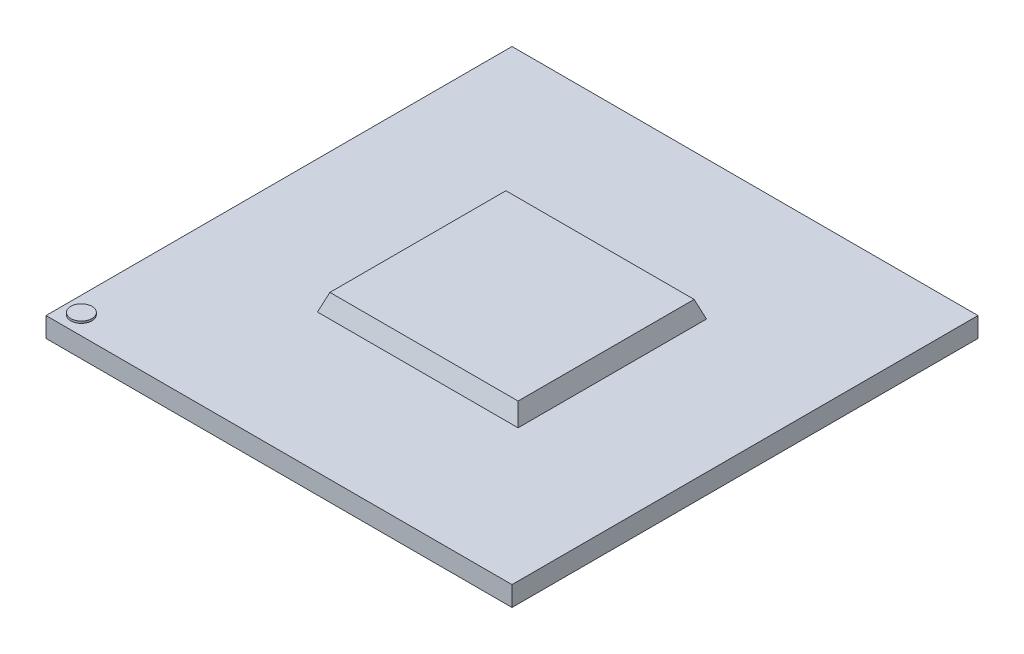
ISO-10303-21;
HEADER;
FILE_DESCRIPTION(('STEP AP214'),'2;1');
FILE_NAME('part.step','',(''),(''),'','','');
FILE_SCHEMA(('AUTOMOTIVE_DESIGN { 1 0 10303 214 1 1 1 1 }'));
ENDSEC;
DATA;
#1=APPLICATION_CONTEXT('core data for automotive mechanical design processes');
#2=APPLICATION_PROTOCOL_DEFINITION('international standard','automotive_design',2000,#1);
#3=PRODUCT_CONTEXT('',#1,'mechanical');
#4=PRODUCT('Part','Part','',(#3));
#5=PRODUCT_RELATED_PRODUCT_CATEGORY('part','',(#4));
#6=PRODUCT_DEFINITION_FORMATION('','',#4);
#7=PRODUCT_DEFINITION_CONTEXT('part definition',#1,'design');
#8=PRODUCT_DEFINITION('design','',#6,#7);
#9=PRODUCT_DEFINITION_SHAPE('','',#8);
#10=(LENGTH_UNIT() NAMED_UNIT(*) SI_UNIT(.MILLI.,.METRE.));
#11=(NAMED_UNIT(*) PLANE_ANGLE_UNIT() SI_UNIT($,.RADIAN.));
#12=(NAMED_UNIT(*) SI_UNIT($,.STERADIAN.) SOLID_ANGLE_UNIT());
#13=UNCERTAINTY_MEASURE_WITH_UNIT(LENGTH_MEASURE(1.E-05),#10,'distance_accuracy_value','');
#14=(GEOMETRIC_REPRESENTATION_CONTEXT(3) GLOBAL_UNCERTAINTY_ASSIGNED_CONTEXT((#13)) GLOBAL_UNIT_ASSIGNED_CONTEXT((#10,
#11,#12)) REPRESENTATION_CONTEXT('',''));
#15=CARTESIAN_POINT('',(0.,0.,0.));
#16=DIRECTION('',(0.,0.,1.));
#17=DIRECTION('',(1.,0.,0.));
#18=AXIS2_PLACEMENT_3D('',#15,#16,#17);
#19=CARTESIAN_POINT('',(-11.5,0.98,11.5));
#20=DIRECTION('',(0.,1.,0.));
#21=DIRECTION('',(0.,0.,1.));
#22=AXIS2_PLACEMENT_3D('',#19,#20,#21);
#23=PLANE('',#22);
#24=DIRECTION('',(1.,0.,0.));
#25=VECTOR('',#24,1.);
#26=CARTESIAN_POINT('',(-4.95,0.98,4.65));
#27=LINE('',#26,#25);
#28=CARTESIAN_POINT('',(-4.95,0.98,4.65));
#29=VERTEX_POINT('',#28);
#30=CARTESIAN_POINT('',(4.95,0.98,4.65));
#31=VERTEX_POINT('',#30);
#32=EDGE_CURVE('E112',#29,#31,#27,.T.);
#33=ORIENTED_EDGE('',*,*,#32,.F.);
#34=DIRECTION('',(0.,0.,1.));
#35=VECTOR('',#34,1.);
#36=CARTESIAN_POINT('',(-4.95,0.98,-4.65));
#37=LINE('',#36,#35);
#38=CARTESIAN_POINT('',(-4.95,0.98,-4.65));
#39=VERTEX_POINT('',#38);
#40=EDGE_CURVE('E123',#39,#29,#37,.T.);
#41=ORIENTED_EDGE('',*,*,#40,.F.);
#42=DIRECTION('',(-1.,0.,0.));
#43=VECTOR('',#42,1.);
#44=CARTESIAN_POINT('',(-4.95,0.98,-4.65));
#45=LINE('',#44,#43);
#46=CARTESIAN_POINT('',(4.95,0.98,-4.65));
#47=VERTEX_POINT('',#46);
#48=EDGE_CURVE('E134',#47,#39,#45,.T.);
#49=ORIENTED_EDGE('',*,*,#48,.F.);
#50=DIRECTION('',(0.,0.,-1.));
#51=VECTOR('',#50,1.);
#52=CARTESIAN_POINT('',(4.95,0.98,-4.65));
#53=LINE('',#52,#51);
#54=EDGE_CURVE('E132',#31,#47,#53,.T.);
#55=ORIENTED_EDGE('',*,*,#54,.F.);
#56=EDGE_LOOP('',(#33,#41,#49,#55));
#57=FACE_BOUND('',#56,.T.);
#58=DIRECTION('',(0.,0.,1.));
#59=VECTOR('',#58,1.);
#60=CARTESIAN_POINT('',(-11.5,0.98,-11.5));
#61=LINE('',#60,#59);
#62=CARTESIAN_POINT('',(-11.5,0.98,-11.5));
#63=VERTEX_POINT('',#62);
#64=CARTESIAN_POINT('',(-11.5,0.98,11.5));
#65=VERTEX_POINT('',#64);
#66=EDGE_CURVE('E149',#63,#65,#61,.T.);
#67=ORIENTED_EDGE('',*,*,#66,.T.);
#68=DIRECTION('',(1.,0.,0.));
#69=VECTOR('',#68,1.);
#70=CARTESIAN_POINT('',(-11.5,0.98,11.5));
#71=LINE('',#70,#69);
#72=CARTESIAN_POINT('',(11.5,0.98,11.5));
#73=VERTEX_POINT('',#72);
#74=EDGE_CURVE('E85',#65,#73,#71,.T.);
#75=ORIENTED_EDGE('',*,*,#74,.T.);
#76=DIRECTION('',(0.,0.,-1.));
#77=VECTOR('',#76,1.);
#78=CARTESIAN_POINT('',(11.5,0.98,-11.5));
#79=LINE('',#78,#77);
#80=CARTESIAN_POINT('',(11.5,0.98,-11.5));
#81=VERTEX_POINT('',#80);
#82=EDGE_CURVE('E152',#73,#81,#79,.T.);
#83=ORIENTED_EDGE('',*,*,#82,.T.);
#84=DIRECTION('',(-1.,0.,0.));
#85=VECTOR('',#84,1.);
#86=CARTESIAN_POINT('',(-11.5,0.98,-11.5));
#87=LINE('',#86,#85);
#88=EDGE_CURVE('E57',#81,#63,#87,.T.);
#89=ORIENTED_EDGE('',*,*,#88,.T.);
#90=EDGE_LOOP('',(#67,#75,#83,#89));
#91=FACE_BOUND('',#90,.T.);
#92=CARTESIAN_POINT('',(-10.6591636233635,0.98,10.5939034379143));
#93=DIRECTION('',(0.,1.,0.));
#94=DIRECTION('',(0.,0.,1.));
#95=AXIS2_PLACEMENT_3D('',#92,#93,#94);
#96=CIRCLE('',#95,0.522081483593315);
#97=CARTESIAN_POINT('',(-10.6591636233635,0.98,11.1159849215077));
#98=VERTEX_POINT('',#97);
#99=EDGE_CURVE('E219',#98,#98,#96,.T.);
#100=ORIENTED_EDGE('',*,*,#99,.F.);
#101=EDGE_LOOP('',(#100));
#102=FACE_BOUND('',#101,.T.);
#103=ADVANCED_FACE('F33',(#57,#91,#102),#23,.T.);
#104=CARTESIAN_POINT('',(-11.5,0.98,-11.5));
#105=DIRECTION('',(1.,0.,0.));
#106=DIRECTION('',(0.,0.,-1.));
#107=AXIS2_PLACEMENT_3D('',#104,#105,#106);
#108=PLANE('',#107);
#109=DIRECTION('',(0.,0.,1.));
#110=VECTOR('',#109,1.);
#111=CARTESIAN_POINT('',(-11.5,0.,-11.5));
#112=LINE('',#111,#110);
#113=CARTESIAN_POINT('',(-11.5,0.,-11.5));
#114=VERTEX_POINT('',#113);
#115=CARTESIAN_POINT('',(-11.5,0.,11.5));
#116=VERTEX_POINT('',#115);
#117=EDGE_CURVE('E118',#114,#116,#112,.T.);
#118=ORIENTED_EDGE('',*,*,#117,.T.);
#119=DIRECTION('',(0.,-1.,0.));
#120=VECTOR('',#119,1.);
#121=CARTESIAN_POINT('',(-11.5,0.98,11.5));
#122=LINE('',#121,#120);
#123=EDGE_CURVE('E11',#65,#116,#122,.T.);
#124=ORIENTED_EDGE('',*,*,#123,.F.);
#125=ORIENTED_EDGE('',*,*,#66,.F.);
#126=DIRECTION('',(0.,-1.,0.));
#127=VECTOR('',#126,1.);
#128=CARTESIAN_POINT('',(-11.5,0.98,-11.5));
#129=LINE('',#128,#127);
#130=EDGE_CURVE('E155',#63,#114,#129,.T.);
#131=ORIENTED_EDGE('',*,*,#130,.T.);
#132=EDGE_LOOP('',(#118,#124,#125,#131));
#133=FACE_BOUND('',#132,.T.);
#134=ADVANCED_FACE('F35',(#133),#108,.F.);
#135=CARTESIAN_POINT('',(-11.5,0.98,11.5));
#136=DIRECTION('',(0.,0.,-1.));
#137=DIRECTION('',(-1.,0.,0.));
#138=AXIS2_PLACEMENT_3D('',#135,#136,#137);
#139=PLANE('',#138);
#140=DIRECTION('',(1.,0.,0.));
#141=VECTOR('',#140,1.);
#142=CARTESIAN_POINT('',(-11.5,0.,11.5));
#143=LINE('',#142,#141);
#144=CARTESIAN_POINT('',(11.5,0.,11.5));
#145=VERTEX_POINT('',#144);
#146=EDGE_CURVE('E158',#116,#145,#143,.T.);
#147=ORIENTED_EDGE('',*,*,#146,.T.);
#148=DIRECTION('',(0.,-1.,0.));
#149=VECTOR('',#148,1.);
#150=CARTESIAN_POINT('',(11.5,0.98,11.5));
#151=LINE('',#150,#149);
#152=EDGE_CURVE('E41',#73,#145,#151,.T.);
#153=ORIENTED_EDGE('',*,*,#152,.F.);
#154=ORIENTED_EDGE('',*,*,#74,.F.);
#155=ORIENTED_EDGE('',*,*,#123,.T.);
#156=EDGE_LOOP('',(#147,#153,#154,#155));
#157=FACE_BOUND('',#156,.T.);
#158=ADVANCED_FACE('F185',(#157),#139,.F.);
#159=CARTESIAN_POINT('',(11.5,0.98,-11.5));
#160=DIRECTION('',(-1.,0.,0.));
#161=DIRECTION('',(0.,0.,1.));
#162=AXIS2_PLACEMENT_3D('',#159,#160,#161);
#163=PLANE('',#162);
#164=DIRECTION('',(0.,0.,-1.));
#165=VECTOR('',#164,1.);
#166=CARTESIAN_POINT('',(11.5,0.,-11.5));
#167=LINE('',#166,#165);
#168=CARTESIAN_POINT('',(11.5,0.,-11.5));
#169=VERTEX_POINT('',#168);
#170=EDGE_CURVE('E160',#145,#169,#167,.T.);
#171=ORIENTED_EDGE('',*,*,#170,.T.);
#172=DIRECTION('',(0.,-1.,0.));
#173=VECTOR('',#172,1.);
#174=CARTESIAN_POINT('',(11.5,0.98,-11.5));
#175=LINE('',#174,#173);
#176=EDGE_CURVE('E164',#81,#169,#175,.T.);
#177=ORIENTED_EDGE('',*,*,#176,.F.);
#178=ORIENTED_EDGE('',*,*,#82,.F.);
#179=ORIENTED_EDGE('',*,*,#152,.T.);
#180=EDGE_LOOP('',(#171,#177,#178,#179));
#181=FACE_BOUND('',#180,.T.);
#182=ADVANCED_FACE('F169',(#181),#163,.F.);
#183=CARTESIAN_POINT('',(-11.5,0.98,-11.5));
#184=DIRECTION('',(0.,0.,1.));
#185=DIRECTION('',(1.,0.,0.));
#186=AXIS2_PLACEMENT_3D('',#183,#184,#185);
#187=PLANE('',#186);
#188=DIRECTION('',(-1.,0.,0.));
#189=VECTOR('',#188,1.);
#190=CARTESIAN_POINT('',(-11.5,0.,-11.5));
#191=LINE('',#190,#189);
#192=EDGE_CURVE('E78',#169,#114,#191,.T.);
#193=ORIENTED_EDGE('',*,*,#192,.T.);
#194=ORIENTED_EDGE('',*,*,#130,.F.);
#195=ORIENTED_EDGE('',*,*,#88,.F.);
#196=ORIENTED_EDGE('',*,*,#176,.T.);
#197=EDGE_LOOP('',(#193,#194,#195,#196));
#198=FACE_BOUND('',#197,.T.);
#199=ADVANCED_FACE('F177',(#198),#187,.F.);
#200=CARTESIAN_POINT('',(-11.5,0.,11.5));
#201=DIRECTION('',(0.,1.,0.));
#202=DIRECTION('',(0.,0.,1.));
#203=AXIS2_PLACEMENT_3D('',#200,#201,#202);
#204=PLANE('',#203);
#205=ORIENTED_EDGE('',*,*,#117,.F.);
#206=ORIENTED_EDGE('',*,*,#192,.F.);
#207=ORIENTED_EDGE('',*,*,#170,.F.);
#208=ORIENTED_EDGE('',*,*,#146,.F.);
#209=EDGE_LOOP('',(#205,#206,#207,#208));
#210=FACE_BOUND('',#209,.T.);
#211=ADVANCED_FACE('F173',(#210),#204,.F.);
#212=CARTESIAN_POINT('',(-4.95,0.98,-4.65));
#213=DIRECTION('',(-0.939692620785908,0.342020143325669,0.));
#214=DIRECTION('',(-0.342020143325669,-0.939692620785909,0.));
#215=AXIS2_PLACEMENT_3D('',#212,#213,#214);
#216=PLANE('',#215);
#217=ORIENTED_EDGE('',*,*,#40,.T.);
#218=DIRECTION('',(-0.323615577118185,-0.889126490715988,0.323615577118185));
#219=VECTOR('',#218,1.);
#220=CARTESIAN_POINT('',(-4.95,0.98,4.65));
#221=LINE('',#220,#219);
#222=CARTESIAN_POINT('',(-4.64426500321639,1.82,4.34426500321639));
#223=VERTEX_POINT('',#222);
#224=EDGE_CURVE('E107',#223,#29,#221,.T.);
#225=ORIENTED_EDGE('',*,*,#224,.F.);
#226=DIRECTION('',(0.,0.,-1.));
#227=VECTOR('',#226,1.);
#228=CARTESIAN_POINT('',(-4.64426500321639,1.82,-4.65));
#229=LINE('',#228,#227);
#230=CARTESIAN_POINT('',(-4.64426500321639,1.82,-4.34426500321639));
#231=VERTEX_POINT('',#230);
#232=EDGE_CURVE('E138',#231,#223,#229,.F.);
#233=ORIENTED_EDGE('',*,*,#232,.F.);
#234=DIRECTION('',(-0.323615577118185,-0.889126490715988,-0.323615577118185));
#235=VECTOR('',#234,1.);
#236=CARTESIAN_POINT('',(-4.95,0.98,-4.65));
#237=LINE('',#236,#235);
#238=EDGE_CURVE('E126',#231,#39,#237,.T.);
#239=ORIENTED_EDGE('',*,*,#238,.T.);
#240=EDGE_LOOP('',(#217,#225,#233,#239));
#241=FACE_BOUND('',#240,.T.);
#242=ADVANCED_FACE('F124',(#241),#216,.T.);
#243=CARTESIAN_POINT('',(-4.95,0.98,4.65));
#244=DIRECTION('',(0.,0.342020143325669,0.939692620785908));
#245=DIRECTION('',(0.,-0.939692620785909,0.342020143325669));
#246=AXIS2_PLACEMENT_3D('',#243,#244,#245);
#247=PLANE('',#246);
#248=ORIENTED_EDGE('',*,*,#32,.T.);
#249=DIRECTION('',(0.323615577118185,-0.889126490715988,0.323615577118185));
#250=VECTOR('',#249,1.);
#251=CARTESIAN_POINT('',(3.97603851169212,3.65593719654433,3.67603851169212));
#252=LINE('',#251,#250);
#253=CARTESIAN_POINT('',(4.64426500321639,1.82,4.34426500321639));
#254=VERTEX_POINT('',#253);
#255=EDGE_CURVE('E119',#254,#31,#252,.T.);
#256=ORIENTED_EDGE('',*,*,#255,.F.);
#257=DIRECTION('',(-1.,0.,0.));
#258=VECTOR('',#257,1.);
#259=CARTESIAN_POINT('',(-4.95,1.82,4.34426500321639));
#260=LINE('',#259,#258);
#261=EDGE_CURVE('E114',#223,#254,#260,.F.);
#262=ORIENTED_EDGE('',*,*,#261,.F.);
#263=ORIENTED_EDGE('',*,*,#224,.T.);
#264=EDGE_LOOP('',(#248,#256,#262,#263));
#265=FACE_BOUND('',#264,.T.);
#266=ADVANCED_FACE('F109',(#265),#247,.T.);
#267=CARTESIAN_POINT('',(4.95,0.98,-4.65));
#268=DIRECTION('',(0.939692620785908,0.342020143325669,0.));
#269=DIRECTION('',(-0.342020143325669,0.939692620785909,0.));
#270=AXIS2_PLACEMENT_3D('',#267,#268,#269);
#271=PLANE('',#270);
#272=ORIENTED_EDGE('',*,*,#54,.T.);
#273=DIRECTION('',(0.323615577118185,-0.889126490715988,-0.323615577118185));
#274=VECTOR('',#273,1.);
#275=CARTESIAN_POINT('',(3.91320228663999,3.8285783059988,-3.61320228664));
#276=LINE('',#275,#274);
#277=CARTESIAN_POINT('',(4.64426500321639,1.82,-4.34426500321639));
#278=VERTEX_POINT('',#277);
#279=EDGE_CURVE('E48',#278,#47,#276,.T.);
#280=ORIENTED_EDGE('',*,*,#279,.F.);
#281=DIRECTION('',(0.,0.,1.));
#282=VECTOR('',#281,1.);
#283=CARTESIAN_POINT('',(4.64426500321639,1.82,-4.65));
#284=LINE('',#283,#282);
#285=EDGE_CURVE('E146',#254,#278,#284,.F.);
#286=ORIENTED_EDGE('',*,*,#285,.F.);
#287=ORIENTED_EDGE('',*,*,#255,.T.);
#288=EDGE_LOOP('',(#272,#280,#286,#287));
#289=FACE_BOUND('',#288,.T.);
#290=ADVANCED_FACE('F195',(#289),#271,.T.);
#291=CARTESIAN_POINT('',(-4.95,0.98,-4.65));
#292=DIRECTION('',(0.,0.342020143325669,-0.939692620785908));
#293=DIRECTION('',(0.,0.939692620785909,0.342020143325669));
#294=AXIS2_PLACEMENT_3D('',#291,#292,#293);
#295=PLANE('',#294);
#296=ORIENTED_EDGE('',*,*,#48,.T.);
#297=ORIENTED_EDGE('',*,*,#238,.F.);
#298=DIRECTION('',(1.,0.,0.));
#299=VECTOR('',#298,1.);
#300=CARTESIAN_POINT('',(-4.95,1.82,-4.34426500321639));
#301=LINE('',#300,#299);
#302=EDGE_CURVE('E141',#278,#231,#301,.F.);
#303=ORIENTED_EDGE('',*,*,#302,.F.);
#304=ORIENTED_EDGE('',*,*,#279,.T.);
#305=EDGE_LOOP('',(#296,#297,#303,#304));
#306=FACE_BOUND('',#305,.T.);
#307=ADVANCED_FACE('F198',(#306),#295,.T.);
#308=CARTESIAN_POINT('',(-4.95,1.82,4.65));
#309=DIRECTION('',(0.,1.,0.));
#310=DIRECTION('',(0.,0.,1.));
#311=AXIS2_PLACEMENT_3D('',#308,#309,#310);
#312=PLANE('',#311);
#313=ORIENTED_EDGE('',*,*,#232,.T.);
#314=ORIENTED_EDGE('',*,*,#261,.T.);
#315=ORIENTED_EDGE('',*,*,#285,.T.);
#316=ORIENTED_EDGE('',*,*,#302,.T.);
#317=EDGE_LOOP('',(#313,#314,#315,#316));
#318=FACE_BOUND('',#317,.T.);
#319=ADVANCED_FACE('F202',(#318),#312,.T.);
#320=CARTESIAN_POINT('',(-10.6591636233635,1.08,10.5939034379143));
#321=DIRECTION('',(0.,-1.,0.));
#322=DIRECTION('',(0.,0.,-1.));
#323=AXIS2_PLACEMENT_3D('',#320,#321,#322);
#324=CYLINDRICAL_SURFACE('',#323,0.522081483593315);
#325=CARTESIAN_POINT('',(-10.6591636233635,1.08,10.5939034379143));
#326=DIRECTION('',(0.,1.,0.));
#327=DIRECTION('',(0.,0.,1.));
#328=AXIS2_PLACEMENT_3D('',#325,#326,#327);
#329=CIRCLE('',#328,0.522081483593315);
#330=CARTESIAN_POINT('',(-10.6591636233635,1.08,11.1159849215077));
#331=VERTEX_POINT('',#330);
#332=EDGE_CURVE('E129',#331,#331,#329,.T.);
#333=ORIENTED_EDGE('',*,*,#332,.F.);
#334=EDGE_LOOP('',(#333));
#335=FACE_BOUND('',#334,.T.);
#336=ORIENTED_EDGE('',*,*,#99,.T.);
#337=EDGE_LOOP('',(#336));
#338=FACE_BOUND('',#337,.T.);
#339=ADVANCED_FACE('F207',(#335,#338),#324,.T.);
#340=CARTESIAN_POINT('',(-10.6591636233635,1.08,10.5939034379143));
#341=DIRECTION('',(0.,1.,0.));
#342=DIRECTION('',(0.,0.,1.));
#343=AXIS2_PLACEMENT_3D('',#340,#341,#342);
#344=PLANE('',#343);
#345=ORIENTED_EDGE('',*,*,#332,.T.);
#346=EDGE_LOOP('',(#345));
#347=FACE_BOUND('',#346,.T.);
#348=ADVANCED_FACE('F211',(#347),#344,.T.);
#349=CLOSED_SHELL('',(#103,#134,#158,#182,#199,#211,#242,#266,#290,#307,#319,#339,#348));
#350=MANIFOLD_SOLID_BREP('B2',#349);
#351=ADVANCED_BREP_SHAPE_REPRESENTATION('',(#18,#350),#14);
#352=SHAPE_DEFINITION_REPRESENTATION(#9,#351);
ENDSEC;
END-ISO-10303-21;
